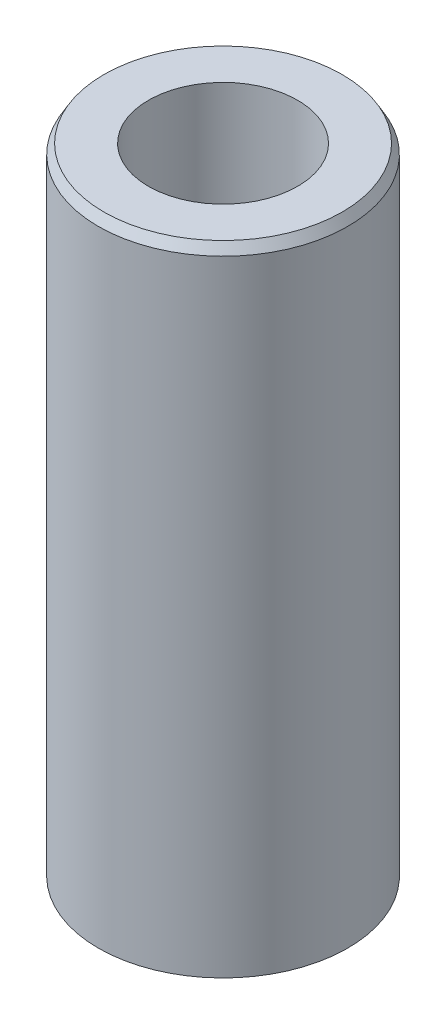
ISO-10303-21;
HEADER;
FILE_DESCRIPTION(('STEP AP214'),'2;1');
FILE_NAME('part.step','',(''),(''),'','','');
FILE_SCHEMA(('AUTOMOTIVE_DESIGN { 1 0 10303 214 1 1 1 1 }'));
ENDSEC;
DATA;
#1=APPLICATION_CONTEXT('core data for automotive mechanical design processes');
#2=APPLICATION_PROTOCOL_DEFINITION('international standard','automotive_design',2000,#1);
#3=PRODUCT_CONTEXT('',#1,'mechanical');
#4=PRODUCT('Part','Part','',(#3));
#5=PRODUCT_RELATED_PRODUCT_CATEGORY('part','',(#4));
#6=PRODUCT_DEFINITION_FORMATION('','',#4);
#7=PRODUCT_DEFINITION_CONTEXT('part definition',#1,'design');
#8=PRODUCT_DEFINITION('design','',#6,#7);
#9=PRODUCT_DEFINITION_SHAPE('','',#8);
#10=(LENGTH_UNIT() NAMED_UNIT(*) SI_UNIT(.MILLI.,.METRE.));
#11=(NAMED_UNIT(*) PLANE_ANGLE_UNIT() SI_UNIT($,.RADIAN.));
#12=(NAMED_UNIT(*) SI_UNIT($,.STERADIAN.) SOLID_ANGLE_UNIT());
#13=UNCERTAINTY_MEASURE_WITH_UNIT(LENGTH_MEASURE(1.E-05),#10,'distance_accuracy_value','');
#14=(GEOMETRIC_REPRESENTATION_CONTEXT(3) GLOBAL_UNCERTAINTY_ASSIGNED_CONTEXT((#13)) GLOBAL_UNIT_ASSIGNED_CONTEXT((#10,
#11,#12)) REPRESENTATION_CONTEXT('',''));
#15=CARTESIAN_POINT('',(0.,0.,0.));
#16=DIRECTION('',(0.,0.,1.));
#17=DIRECTION('',(1.,0.,0.));
#18=AXIS2_PLACEMENT_3D('',#15,#16,#17);
#19=CARTESIAN_POINT('',(0.,38.5028819866384,0.));
#20=DIRECTION('',(0.,-1.,0.));
#21=DIRECTION('',(0.,0.,-1.));
#22=AXIS2_PLACEMENT_3D('',#19,#20,#21);
#23=CYLINDRICAL_SURFACE('',#22,7.5);
#24=CARTESIAN_POINT('',(0.,37.922074571648,0.));
#25=DIRECTION('',(0.,1.,0.));
#26=DIRECTION('',(0.,0.,1.));
#27=AXIS2_PLACEMENT_3D('',#24,#25,#26);
#28=CIRCLE('',#27,7.5);
#29=CARTESIAN_POINT('',(0.,37.922074571648,7.5));
#30=VERTEX_POINT('',#29);
#31=EDGE_CURVE('E50',#30,#30,#28,.F.);
#32=ORIENTED_EDGE('',*,*,#31,.T.);
#33=EDGE_LOOP('',(#32));
#34=FACE_BOUND('',#33,.T.);
#35=CARTESIAN_POINT('',(0.,0.335329317392032,0.));
#36=DIRECTION('',(0.,1.,0.));
#37=DIRECTION('',(0.,0.,1.));
#38=AXIS2_PLACEMENT_3D('',#35,#36,#37);
#39=CIRCLE('',#38,7.5);
#40=CARTESIAN_POINT('',(0.,0.335329317392032,7.5));
#41=VERTEX_POINT('',#40);
#42=EDGE_CURVE('E51',#41,#41,#39,.T.);
#43=ORIENTED_EDGE('',*,*,#42,.T.);
#44=EDGE_LOOP('',(#43));
#45=FACE_BOUND('',#44,.T.);
#46=ADVANCED_FACE('F39',(#34,#45),#23,.T.);
#47=CARTESIAN_POINT('',(0.,38.5028819866384,0.));
#48=DIRECTION('',(0.,1.,0.));
#49=DIRECTION('',(0.,0.,1.));
#50=AXIS2_PLACEMENT_3D('',#47,#48,#49);
#51=PLANE('',#50);
#52=CARTESIAN_POINT('',(0.,38.5028819866384,0.));
#53=DIRECTION('',(0.,1.,0.));
#54=DIRECTION('',(0.,0.,1.));
#55=AXIS2_PLACEMENT_3D('',#52,#53,#54);
#56=CIRCLE('',#55,7.16467068260797);
#57=CARTESIAN_POINT('',(0.,38.5028819866384,7.16467068260797));
#58=VERTEX_POINT('',#57);
#59=EDGE_CURVE('E54',#58,#58,#56,.T.);
#60=ORIENTED_EDGE('',*,*,#59,.T.);
#61=EDGE_LOOP('',(#60));
#62=FACE_BOUND('',#61,.T.);
#63=CARTESIAN_POINT('',(0.,38.5028819866384,0.));
#64=DIRECTION('',(0.,1.,0.));
#65=DIRECTION('',(0.,0.,1.));
#66=AXIS2_PLACEMENT_3D('',#63,#64,#65);
#67=CIRCLE('',#66,4.48679682083736);
#68=CARTESIAN_POINT('',(0.,38.5028819866384,4.48679682083736));
#69=VERTEX_POINT('',#68);
#70=EDGE_CURVE('E58',#69,#69,#67,.T.);
#71=ORIENTED_EDGE('',*,*,#70,.F.);
#72=EDGE_LOOP('',(#71));
#73=FACE_BOUND('',#72,.T.);
#74=ADVANCED_FACE('F69',(#62,#73),#51,.T.);
#75=CARTESIAN_POINT('',(0.,0.,0.));
#76=DIRECTION('',(0.,1.,0.));
#77=DIRECTION('',(0.,0.,1.));
#78=AXIS2_PLACEMENT_3D('',#75,#76,#77);
#79=PLANE('',#78);
#80=CARTESIAN_POINT('',(0.,0.,0.));
#81=DIRECTION('',(0.,1.,0.));
#82=DIRECTION('',(0.,0.,1.));
#83=AXIS2_PLACEMENT_3D('',#80,#81,#82);
#84=CIRCLE('',#83,6.9191925850096);
#85=CARTESIAN_POINT('',(0.,0.,6.9191925850096));
#86=VERTEX_POINT('',#85);
#87=EDGE_CURVE('E10',#86,#86,#84,.F.);
#88=ORIENTED_EDGE('',*,*,#87,.T.);
#89=EDGE_LOOP('',(#88));
#90=FACE_BOUND('',#89,.T.);
#91=CARTESIAN_POINT('',(0.,0.,0.));
#92=DIRECTION('',(0.,1.,0.));
#93=DIRECTION('',(0.,0.,1.));
#94=AXIS2_PLACEMENT_3D('',#91,#92,#93);
#95=CIRCLE('',#94,4.48679682083736);
#96=CARTESIAN_POINT('',(0.,0.,4.48679682083736));
#97=VERTEX_POINT('',#96);
#98=EDGE_CURVE('E63',#97,#97,#95,.T.);
#99=ORIENTED_EDGE('',*,*,#98,.T.);
#100=EDGE_LOOP('',(#99));
#101=FACE_BOUND('',#100,.T.);
#102=ADVANCED_FACE('F75',(#90,#101),#79,.F.);
#103=CARTESIAN_POINT('',(0.,38.5028819866384,0.));
#104=DIRECTION('',(0.,-1.,0.));
#105=DIRECTION('',(0.,0.,-1.));
#106=AXIS2_PLACEMENT_3D('',#103,#104,#105);
#107=CYLINDRICAL_SURFACE('',#106,4.48679682083736);
#108=ORIENTED_EDGE('',*,*,#70,.T.);
#109=EDGE_LOOP('',(#108));
#110=FACE_BOUND('',#109,.T.);
#111=ORIENTED_EDGE('',*,*,#98,.F.);
#112=EDGE_LOOP('',(#111));
#113=FACE_BOUND('',#112,.T.);
#114=ADVANCED_FACE('F70',(#110,#113),#107,.F.);
#115=CARTESIAN_POINT('',(0.,38.5028819866384,0.));
#116=DIRECTION('',(0.,-1.,0.));
#117=DIRECTION('',(0.,0.,-1.));
#118=AXIS2_PLACEMENT_3D('',#115,#116,#117);
#119=CONICAL_SURFACE('',#118,7.16467068260797,0.523598775598297);
#120=ORIENTED_EDGE('',*,*,#31,.F.);
#121=EDGE_LOOP('',(#120));
#122=FACE_BOUND('',#121,.T.);
#123=ORIENTED_EDGE('',*,*,#59,.F.);
#124=EDGE_LOOP('',(#123));
#125=FACE_BOUND('',#124,.T.);
#126=ADVANCED_FACE('F81',(#122,#125),#119,.T.);
#127=CARTESIAN_POINT('',(0.,0.335329317392032,0.));
#128=DIRECTION('',(0.,1.,0.));
#129=DIRECTION('',(0.,0.,1.));
#130=AXIS2_PLACEMENT_3D('',#127,#128,#129);
#131=CONICAL_SURFACE('',#130,7.5,1.0471975511966);
#132=ORIENTED_EDGE('',*,*,#87,.F.);
#133=EDGE_LOOP('',(#132));
#134=FACE_BOUND('',#133,.T.);
#135=ORIENTED_EDGE('',*,*,#42,.F.);
#136=EDGE_LOOP('',(#135));
#137=FACE_BOUND('',#136,.T.);
#138=ADVANCED_FACE('F45',(#134,#137),#131,.T.);
#139=CLOSED_SHELL('',(#46,#74,#102,#114,#126,#138));
#140=MANIFOLD_SOLID_BREP('B2',#139);
#141=ADVANCED_BREP_SHAPE_REPRESENTATION('',(#18,#140),#14);
#142=SHAPE_DEFINITION_REPRESENTATION(#9,#141);
ENDSEC;
END-ISO-10303-21;
